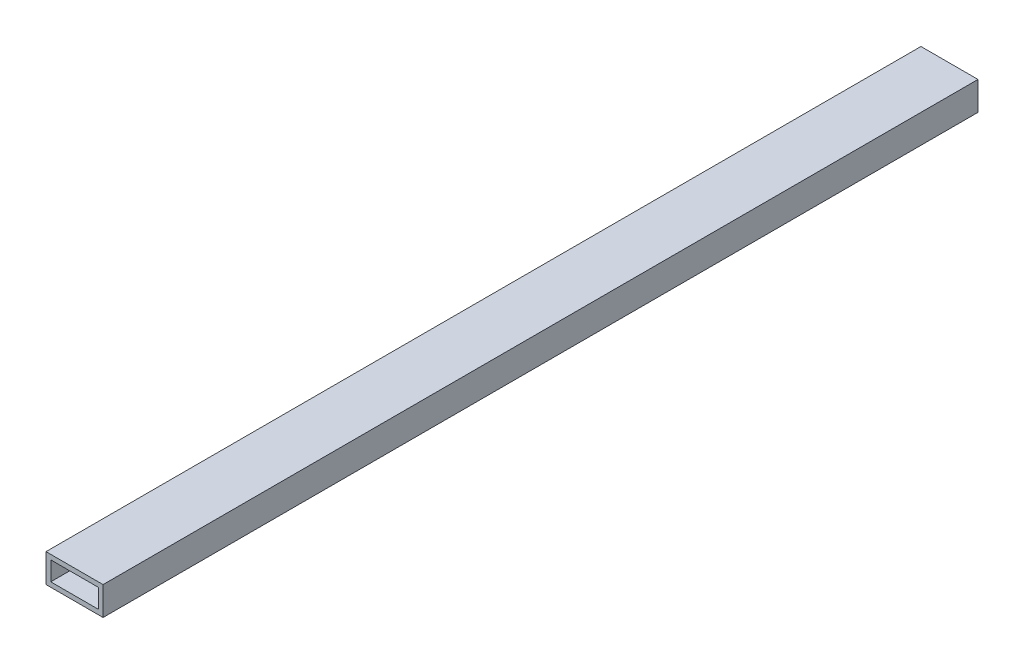
ISO-10303-21;
HEADER;
FILE_DESCRIPTION(('STEP AP214'),'2;1');
FILE_NAME('part.step','',(''),(''),'','','');
FILE_SCHEMA(('AUTOMOTIVE_DESIGN { 1 0 10303 214 1 1 1 1 }'));
ENDSEC;
DATA;
#1=APPLICATION_CONTEXT('core data for automotive mechanical design processes');
#2=APPLICATION_PROTOCOL_DEFINITION('international standard','automotive_design',2000,#1);
#3=PRODUCT_CONTEXT('',#1,'mechanical');
#4=PRODUCT('Part','Part','',(#3));
#5=PRODUCT_RELATED_PRODUCT_CATEGORY('part','',(#4));
#6=PRODUCT_DEFINITION_FORMATION('','',#4);
#7=PRODUCT_DEFINITION_CONTEXT('part definition',#1,'design');
#8=PRODUCT_DEFINITION('design','',#6,#7);
#9=PRODUCT_DEFINITION_SHAPE('','',#8);
#10=(LENGTH_UNIT() NAMED_UNIT(*) SI_UNIT(.MILLI.,.METRE.));
#11=(NAMED_UNIT(*) PLANE_ANGLE_UNIT() SI_UNIT($,.RADIAN.));
#12=(NAMED_UNIT(*) SI_UNIT($,.STERADIAN.) SOLID_ANGLE_UNIT());
#13=UNCERTAINTY_MEASURE_WITH_UNIT(LENGTH_MEASURE(1.E-05),#10,'distance_accuracy_value','');
#14=(GEOMETRIC_REPRESENTATION_CONTEXT(3) GLOBAL_UNCERTAINTY_ASSIGNED_CONTEXT((#13)) GLOBAL_UNIT_ASSIGNED_CONTEXT((#10,
#11,#12)) REPRESENTATION_CONTEXT('',''));
#15=CARTESIAN_POINT('',(0.,0.,0.));
#16=DIRECTION('',(0.,0.,1.));
#17=DIRECTION('',(1.,0.,0.));
#18=AXIS2_PLACEMENT_3D('',#15,#16,#17);
#19=CARTESIAN_POINT('',(-12.5588888888889,10.0894444444444,584.2));
#20=DIRECTION('',(0.,1.,0.));
#21=DIRECTION('',(0.,0.,1.));
#22=AXIS2_PLACEMENT_3D('',#19,#20,#21);
#23=PLANE('',#22);
#24=DIRECTION('',(1.,0.,0.));
#25=VECTOR('',#24,1.);
#26=CARTESIAN_POINT('',(-12.5588888888889,10.0894444444444,0.));
#27=LINE('',#26,#25);
#28=CARTESIAN_POINT('',(-12.5588888888889,10.0894444444444,0.));
#29=VERTEX_POINT('',#28);
#30=CARTESIAN_POINT('',(25.5411111111111,10.0894444444444,0.));
#31=VERTEX_POINT('',#30);
#32=EDGE_CURVE('E131',#29,#31,#27,.T.);
#33=ORIENTED_EDGE('',*,*,#32,.F.);
#34=DIRECTION('',(0.,0.,-1.));
#35=VECTOR('',#34,1.);
#36=CARTESIAN_POINT('',(-12.5588888888889,10.0894444444444,584.2));
#37=LINE('',#36,#35);
#38=CARTESIAN_POINT('',(-12.5588888888889,10.0894444444444,584.2));
#39=VERTEX_POINT('',#38);
#40=EDGE_CURVE('E11',#39,#29,#37,.T.);
#41=ORIENTED_EDGE('',*,*,#40,.F.);
#42=DIRECTION('',(1.,0.,0.));
#43=VECTOR('',#42,1.);
#44=CARTESIAN_POINT('',(-12.5588888888889,10.0894444444444,584.2));
#45=LINE('',#44,#43);
#46=CARTESIAN_POINT('',(25.5411111111111,10.0894444444444,584.2));
#47=VERTEX_POINT('',#46);
#48=EDGE_CURVE('E135',#39,#47,#45,.T.);
#49=ORIENTED_EDGE('',*,*,#48,.T.);
#50=DIRECTION('',(0.,0.,-1.));
#51=VECTOR('',#50,1.);
#52=CARTESIAN_POINT('',(25.5411111111111,10.0894444444444,584.2));
#53=LINE('',#52,#51);
#54=EDGE_CURVE('E36',#47,#31,#53,.T.);
#55=ORIENTED_EDGE('',*,*,#54,.T.);
#56=EDGE_LOOP('',(#33,#41,#49,#55));
#57=FACE_BOUND('',#56,.T.);
#58=ADVANCED_FACE('F33',(#57),#23,.T.);
#59=CARTESIAN_POINT('',(-12.5588888888889,10.0894444444444,584.2));
#60=DIRECTION('',(1.,0.,0.));
#61=DIRECTION('',(0.,1.,0.));
#62=AXIS2_PLACEMENT_3D('',#59,#60,#61);
#63=PLANE('',#62);
#64=DIRECTION('',(0.,-1.,0.));
#65=VECTOR('',#64,1.);
#66=CARTESIAN_POINT('',(-12.5588888888889,10.0894444444444,0.));
#67=LINE('',#66,#65);
#68=CARTESIAN_POINT('',(-12.5588888888889,-8.96055555555556,0.));
#69=VERTEX_POINT('',#68);
#70=EDGE_CURVE('E139',#29,#69,#67,.T.);
#71=ORIENTED_EDGE('',*,*,#70,.T.);
#72=DIRECTION('',(0.,0.,-1.));
#73=VECTOR('',#72,1.);
#74=CARTESIAN_POINT('',(-12.5588888888889,-8.96055555555556,584.2));
#75=LINE('',#74,#73);
#76=CARTESIAN_POINT('',(-12.5588888888889,-8.96055555555556,584.2));
#77=VERTEX_POINT('',#76);
#78=EDGE_CURVE('E41',#77,#69,#75,.T.);
#79=ORIENTED_EDGE('',*,*,#78,.F.);
#80=DIRECTION('',(0.,-1.,0.));
#81=VECTOR('',#80,1.);
#82=CARTESIAN_POINT('',(-12.5588888888889,10.0894444444444,584.2));
#83=LINE('',#82,#81);
#84=EDGE_CURVE('E144',#39,#77,#83,.T.);
#85=ORIENTED_EDGE('',*,*,#84,.F.);
#86=ORIENTED_EDGE('',*,*,#40,.T.);
#87=EDGE_LOOP('',(#71,#79,#85,#86));
#88=FACE_BOUND('',#87,.T.);
#89=ADVANCED_FACE('F171',(#88),#63,.F.);
#90=CARTESIAN_POINT('',(-12.5588888888889,-8.96055555555556,584.2));
#91=DIRECTION('',(0.,1.,0.));
#92=DIRECTION('',(0.,0.,1.));
#93=AXIS2_PLACEMENT_3D('',#90,#91,#92);
#94=PLANE('',#93);
#95=DIRECTION('',(1.,0.,0.));
#96=VECTOR('',#95,1.);
#97=CARTESIAN_POINT('',(-12.5588888888889,-8.96055555555556,0.));
#98=LINE('',#97,#96);
#99=CARTESIAN_POINT('',(25.5411111111111,-8.96055555555556,0.));
#100=VERTEX_POINT('',#99);
#101=EDGE_CURVE('E151',#69,#100,#98,.T.);
#102=ORIENTED_EDGE('',*,*,#101,.T.);
#103=DIRECTION('',(0.,0.,-1.));
#104=VECTOR('',#103,1.);
#105=CARTESIAN_POINT('',(25.5411111111111,-8.96055555555556,584.2));
#106=LINE('',#105,#104);
#107=CARTESIAN_POINT('',(25.5411111111111,-8.96055555555556,584.2));
#108=VERTEX_POINT('',#107);
#109=EDGE_CURVE('E156',#108,#100,#106,.T.);
#110=ORIENTED_EDGE('',*,*,#109,.F.);
#111=DIRECTION('',(1.,0.,0.));
#112=VECTOR('',#111,1.);
#113=CARTESIAN_POINT('',(-12.5588888888889,-8.96055555555556,584.2));
#114=LINE('',#113,#112);
#115=EDGE_CURVE('E142',#77,#108,#114,.T.);
#116=ORIENTED_EDGE('',*,*,#115,.F.);
#117=ORIENTED_EDGE('',*,*,#78,.T.);
#118=EDGE_LOOP('',(#102,#110,#116,#117));
#119=FACE_BOUND('',#118,.T.);
#120=ADVANCED_FACE('F175',(#119),#94,.F.);
#121=CARTESIAN_POINT('',(25.5411111111111,10.0894444444444,584.2));
#122=DIRECTION('',(1.,0.,0.));
#123=DIRECTION('',(0.,1.,0.));
#124=AXIS2_PLACEMENT_3D('',#121,#122,#123);
#125=PLANE('',#124);
#126=DIRECTION('',(0.,-1.,0.));
#127=VECTOR('',#126,1.);
#128=CARTESIAN_POINT('',(25.5411111111111,10.0894444444444,0.));
#129=LINE('',#128,#127);
#130=EDGE_CURVE('E148',#31,#100,#129,.T.);
#131=ORIENTED_EDGE('',*,*,#130,.F.);
#132=ORIENTED_EDGE('',*,*,#54,.F.);
#133=DIRECTION('',(0.,-1.,0.));
#134=VECTOR('',#133,1.);
#135=CARTESIAN_POINT('',(25.5411111111111,10.0894444444444,584.2));
#136=LINE('',#135,#134);
#137=EDGE_CURVE('E138',#47,#108,#136,.T.);
#138=ORIENTED_EDGE('',*,*,#137,.T.);
#139=ORIENTED_EDGE('',*,*,#109,.T.);
#140=EDGE_LOOP('',(#131,#132,#138,#139));
#141=FACE_BOUND('',#140,.T.);
#142=ADVANCED_FACE('F164',(#141),#125,.T.);
#143=CARTESIAN_POINT('',(0.,0.,584.2));
#144=DIRECTION('',(0.,0.,-1.));
#145=DIRECTION('',(-1.,0.,0.));
#146=AXIS2_PLACEMENT_3D('',#143,#144,#145);
#147=PLANE('',#146);
#148=DIRECTION('',(-1.,0.,0.));
#149=VECTOR('',#148,1.);
#150=CARTESIAN_POINT('',(22.3661111111111,-5.78555555555556,584.2));
#151=LINE('',#150,#149);
#152=CARTESIAN_POINT('',(22.3661111111111,-5.78555555555556,584.2));
#153=VERTEX_POINT('',#152);
#154=CARTESIAN_POINT('',(-9.38388888888888,-5.78555555555556,584.2));
#155=VERTEX_POINT('',#154);
#156=EDGE_CURVE('E106',#153,#155,#151,.T.);
#157=ORIENTED_EDGE('',*,*,#156,.T.);
#158=DIRECTION('',(0.,1.,0.));
#159=VECTOR('',#158,1.);
#160=CARTESIAN_POINT('',(-9.38388888888888,-5.78555555555556,584.2));
#161=LINE('',#160,#159);
#162=CARTESIAN_POINT('',(-9.38388888888889,6.91444444444444,584.2));
#163=VERTEX_POINT('',#162);
#164=EDGE_CURVE('E100',#155,#163,#161,.T.);
#165=ORIENTED_EDGE('',*,*,#164,.T.);
#166=DIRECTION('',(1.,0.,0.));
#167=VECTOR('',#166,1.);
#168=CARTESIAN_POINT('',(-9.38388888888889,6.91444444444444,584.2));
#169=LINE('',#168,#167);
#170=CARTESIAN_POINT('',(22.3661111111111,6.91444444444444,584.2));
#171=VERTEX_POINT('',#170);
#172=EDGE_CURVE('E109',#163,#171,#169,.T.);
#173=ORIENTED_EDGE('',*,*,#172,.T.);
#174=DIRECTION('',(0.,-1.,0.));
#175=VECTOR('',#174,1.);
#176=CARTESIAN_POINT('',(22.3661111111111,6.91444444444444,584.2));
#177=LINE('',#176,#175);
#178=EDGE_CURVE('E49',#171,#153,#177,.T.);
#179=ORIENTED_EDGE('',*,*,#178,.T.);
#180=EDGE_LOOP('',(#157,#165,#173,#179));
#181=FACE_BOUND('',#180,.T.);
#182=ORIENTED_EDGE('',*,*,#48,.F.);
#183=ORIENTED_EDGE('',*,*,#84,.T.);
#184=ORIENTED_EDGE('',*,*,#115,.T.);
#185=ORIENTED_EDGE('',*,*,#137,.F.);
#186=EDGE_LOOP('',(#182,#183,#184,#185));
#187=FACE_BOUND('',#186,.T.);
#188=ADVANCED_FACE('F113',(#181,#187),#147,.F.);
#189=CARTESIAN_POINT('',(0.,0.,0.));
#190=DIRECTION('',(0.,0.,-1.));
#191=DIRECTION('',(-1.,0.,0.));
#192=AXIS2_PLACEMENT_3D('',#189,#190,#191);
#193=PLANE('',#192);
#194=DIRECTION('',(0.,1.,0.));
#195=VECTOR('',#194,1.);
#196=CARTESIAN_POINT('',(-9.38388888888888,-5.78555555555556,0.));
#197=LINE('',#196,#195);
#198=CARTESIAN_POINT('',(-9.38388888888888,-5.78555555555556,0.));
#199=VERTEX_POINT('',#198);
#200=CARTESIAN_POINT('',(-9.38388888888889,6.91444444444444,0.));
#201=VERTEX_POINT('',#200);
#202=EDGE_CURVE('E57',#199,#201,#197,.T.);
#203=ORIENTED_EDGE('',*,*,#202,.F.);
#204=DIRECTION('',(-1.,0.,0.));
#205=VECTOR('',#204,1.);
#206=CARTESIAN_POINT('',(22.3661111111111,-5.78555555555556,0.));
#207=LINE('',#206,#205);
#208=CARTESIAN_POINT('',(22.3661111111111,-5.78555555555556,0.));
#209=VERTEX_POINT('',#208);
#210=EDGE_CURVE('E116',#209,#199,#207,.T.);
#211=ORIENTED_EDGE('',*,*,#210,.F.);
#212=DIRECTION('',(0.,-1.,0.));
#213=VECTOR('',#212,1.);
#214=CARTESIAN_POINT('',(22.3661111111111,6.91444444444444,0.));
#215=LINE('',#214,#213);
#216=CARTESIAN_POINT('',(22.3661111111111,6.91444444444444,0.));
#217=VERTEX_POINT('',#216);
#218=EDGE_CURVE('E119',#217,#209,#215,.T.);
#219=ORIENTED_EDGE('',*,*,#218,.F.);
#220=DIRECTION('',(1.,0.,0.));
#221=VECTOR('',#220,1.);
#222=CARTESIAN_POINT('',(-9.38388888888889,6.91444444444444,0.));
#223=LINE('',#222,#221);
#224=EDGE_CURVE('E125',#201,#217,#223,.T.);
#225=ORIENTED_EDGE('',*,*,#224,.F.);
#226=EDGE_LOOP('',(#203,#211,#219,#225));
#227=FACE_BOUND('',#226,.T.);
#228=ORIENTED_EDGE('',*,*,#32,.T.);
#229=ORIENTED_EDGE('',*,*,#130,.T.);
#230=ORIENTED_EDGE('',*,*,#101,.F.);
#231=ORIENTED_EDGE('',*,*,#70,.F.);
#232=EDGE_LOOP('',(#228,#229,#230,#231));
#233=FACE_BOUND('',#232,.T.);
#234=ADVANCED_FACE('F168',(#227,#233),#193,.T.);
#235=CARTESIAN_POINT('',(-9.38388888888888,-5.78555555555556,584.2));
#236=DIRECTION('',(-1.,0.,0.));
#237=DIRECTION('',(0.,-1.,0.));
#238=AXIS2_PLACEMENT_3D('',#235,#236,#237);
#239=PLANE('',#238);
#240=ORIENTED_EDGE('',*,*,#202,.T.);
#241=DIRECTION('',(0.,0.,-1.));
#242=VECTOR('',#241,1.);
#243=CARTESIAN_POINT('',(-9.38388888888889,6.91444444444444,584.2));
#244=LINE('',#243,#242);
#245=EDGE_CURVE('E96',#163,#201,#244,.T.);
#246=ORIENTED_EDGE('',*,*,#245,.F.);
#247=ORIENTED_EDGE('',*,*,#164,.F.);
#248=DIRECTION('',(0.,0.,-1.));
#249=VECTOR('',#248,1.);
#250=CARTESIAN_POINT('',(-9.38388888888888,-5.78555555555556,584.2));
#251=LINE('',#250,#249);
#252=EDGE_CURVE('E129',#155,#199,#251,.T.);
#253=ORIENTED_EDGE('',*,*,#252,.T.);
#254=EDGE_LOOP('',(#240,#246,#247,#253));
#255=FACE_BOUND('',#254,.T.);
#256=ADVANCED_FACE('F98',(#255),#239,.F.);
#257=CARTESIAN_POINT('',(22.3661111111111,-5.78555555555556,584.2));
#258=DIRECTION('',(0.,-1.,0.));
#259=DIRECTION('',(0.,0.,-1.));
#260=AXIS2_PLACEMENT_3D('',#257,#258,#259);
#261=PLANE('',#260);
#262=ORIENTED_EDGE('',*,*,#210,.T.);
#263=ORIENTED_EDGE('',*,*,#252,.F.);
#264=ORIENTED_EDGE('',*,*,#156,.F.);
#265=DIRECTION('',(0.,0.,-1.));
#266=VECTOR('',#265,1.);
#267=CARTESIAN_POINT('',(22.3661111111111,-5.78555555555556,584.2));
#268=LINE('',#267,#266);
#269=EDGE_CURVE('E132',#153,#209,#268,.T.);
#270=ORIENTED_EDGE('',*,*,#269,.T.);
#271=EDGE_LOOP('',(#262,#263,#264,#270));
#272=FACE_BOUND('',#271,.T.);
#273=ADVANCED_FACE('F219',(#272),#261,.F.);
#274=CARTESIAN_POINT('',(22.3661111111111,6.91444444444444,584.2));
#275=DIRECTION('',(1.,0.,0.));
#276=DIRECTION('',(0.,1.,0.));
#277=AXIS2_PLACEMENT_3D('',#274,#275,#276);
#278=PLANE('',#277);
#279=ORIENTED_EDGE('',*,*,#218,.T.);
#280=ORIENTED_EDGE('',*,*,#269,.F.);
#281=ORIENTED_EDGE('',*,*,#178,.F.);
#282=DIRECTION('',(0.,0.,-1.));
#283=VECTOR('',#282,1.);
#284=CARTESIAN_POINT('',(22.3661111111111,6.91444444444444,584.2));
#285=LINE('',#284,#283);
#286=EDGE_CURVE('E105',#171,#217,#285,.T.);
#287=ORIENTED_EDGE('',*,*,#286,.T.);
#288=EDGE_LOOP('',(#279,#280,#281,#287));
#289=FACE_BOUND('',#288,.T.);
#290=ADVANCED_FACE('F227',(#289),#278,.F.);
#291=CARTESIAN_POINT('',(-9.38388888888889,6.91444444444444,584.2));
#292=DIRECTION('',(0.,1.,0.));
#293=DIRECTION('',(0.,0.,1.));
#294=AXIS2_PLACEMENT_3D('',#291,#292,#293);
#295=PLANE('',#294);
#296=ORIENTED_EDGE('',*,*,#224,.T.);
#297=ORIENTED_EDGE('',*,*,#286,.F.);
#298=ORIENTED_EDGE('',*,*,#172,.F.);
#299=ORIENTED_EDGE('',*,*,#245,.T.);
#300=EDGE_LOOP('',(#296,#297,#298,#299));
#301=FACE_BOUND('',#300,.T.);
#302=ADVANCED_FACE('F110',(#301),#295,.F.);
#303=CLOSED_SHELL('',(#58,#89,#120,#142,#188,#234,#256,#273,#290,#302));
#304=MANIFOLD_SOLID_BREP('B2',#303);
#305=ADVANCED_BREP_SHAPE_REPRESENTATION('',(#18,#304),#14);
#306=SHAPE_DEFINITION_REPRESENTATION(#9,#305);
ENDSEC;
END-ISO-10303-21;
